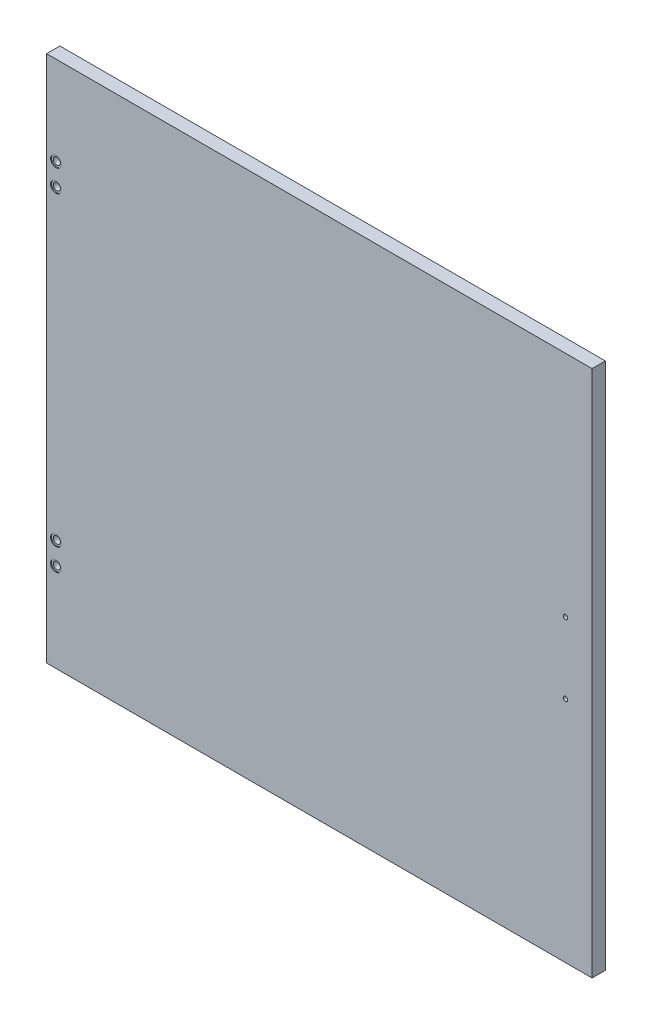
ISO-10303-21;
HEADER;
FILE_DESCRIPTION(('STEP AP214'),'2;1');
FILE_NAME('part.step','',(''),(''),'','','');
FILE_SCHEMA(('AUTOMOTIVE_DESIGN { 1 0 10303 214 1 1 1 1 }'));
ENDSEC;
DATA;
#1=APPLICATION_CONTEXT('core data for automotive mechanical design processes');
#2=APPLICATION_PROTOCOL_DEFINITION('international standard','automotive_design',2000,#1);
#3=PRODUCT_CONTEXT('',#1,'mechanical');
#4=PRODUCT('Part','Part','',(#3));
#5=PRODUCT_RELATED_PRODUCT_CATEGORY('part','',(#4));
#6=PRODUCT_DEFINITION_FORMATION('','',#4);
#7=PRODUCT_DEFINITION_CONTEXT('part definition',#1,'design');
#8=PRODUCT_DEFINITION('design','',#6,#7);
#9=PRODUCT_DEFINITION_SHAPE('','',#8);
#10=(LENGTH_UNIT() NAMED_UNIT(*) SI_UNIT(.MILLI.,.METRE.));
#11=(NAMED_UNIT(*) PLANE_ANGLE_UNIT() SI_UNIT($,.RADIAN.));
#12=(NAMED_UNIT(*) SI_UNIT($,.STERADIAN.) SOLID_ANGLE_UNIT());
#13=UNCERTAINTY_MEASURE_WITH_UNIT(LENGTH_MEASURE(1.E-05),#10,'distance_accuracy_value','');
#14=(GEOMETRIC_REPRESENTATION_CONTEXT(3) GLOBAL_UNCERTAINTY_ASSIGNED_CONTEXT((#13)) GLOBAL_UNIT_ASSIGNED_CONTEXT((#10,
#11,#12)) REPRESENTATION_CONTEXT('',''));
#15=CARTESIAN_POINT('',(0.,0.,0.));
#16=DIRECTION('',(0.,0.,1.));
#17=DIRECTION('',(1.,0.,0.));
#18=AXIS2_PLACEMENT_3D('',#15,#16,#17);
#19=CARTESIAN_POINT('',(-297.,-172.5,0.));
#20=DIRECTION('',(0.,0.,1.));
#21=DIRECTION('',(1.,0.,0.));
#22=AXIS2_PLACEMENT_3D('',#19,#20,#21);
#23=CYLINDRICAL_SURFACE('',#22,3.99999999999999);
#24=CARTESIAN_POINT('',(-297.,-172.5,0.));
#25=DIRECTION('',(0.,0.,-1.));
#26=DIRECTION('',(1.,0.,0.));
#27=AXIS2_PLACEMENT_3D('',#24,#25,#26);
#28=CIRCLE('',#27,3.99999999999999);
#29=CARTESIAN_POINT('',(-293.,-172.5,0.));
#30=VERTEX_POINT('',#29);
#31=EDGE_CURVE('E119',#30,#30,#28,.T.);
#32=ORIENTED_EDGE('',*,*,#31,.T.);
#33=EDGE_LOOP('',(#32));
#34=FACE_BOUND('',#33,.T.);
#35=CARTESIAN_POINT('',(-297.,-172.5,14.));
#36=DIRECTION('',(0.,0.,1.));
#37=DIRECTION('',(1.,0.,0.));
#38=AXIS2_PLACEMENT_3D('',#35,#36,#37);
#39=CIRCLE('',#38,3.99999999999999);
#40=CARTESIAN_POINT('',(-293.,-172.5,14.));
#41=VERTEX_POINT('',#40);
#42=EDGE_CURVE('E41',#41,#41,#39,.T.);
#43=ORIENTED_EDGE('',*,*,#42,.T.);
#44=EDGE_LOOP('',(#43));
#45=FACE_BOUND('',#44,.T.);
#46=ADVANCED_FACE('F37',(#34,#45),#23,.F.);
#47=CARTESIAN_POINT('',(-297.,-197.5,0.));
#48=DIRECTION('',(0.,0.,1.));
#49=DIRECTION('',(1.,0.,0.));
#50=AXIS2_PLACEMENT_3D('',#47,#48,#49);
#51=CYLINDRICAL_SURFACE('',#50,3.99999999999999);
#52=CARTESIAN_POINT('',(-297.,-197.5,0.));
#53=DIRECTION('',(0.,0.,-1.));
#54=DIRECTION('',(1.,0.,0.));
#55=AXIS2_PLACEMENT_3D('',#52,#53,#54);
#56=CIRCLE('',#55,3.99999999999999);
#57=CARTESIAN_POINT('',(-293.,-197.5,0.));
#58=VERTEX_POINT('',#57);
#59=EDGE_CURVE('E155',#58,#58,#56,.T.);
#60=ORIENTED_EDGE('',*,*,#59,.T.);
#61=EDGE_LOOP('',(#60));
#62=FACE_BOUND('',#61,.T.);
#63=CARTESIAN_POINT('',(-297.,-197.5,14.));
#64=DIRECTION('',(0.,0.,1.));
#65=DIRECTION('',(1.,0.,0.));
#66=AXIS2_PLACEMENT_3D('',#63,#64,#65);
#67=CIRCLE('',#66,3.99999999999999);
#68=CARTESIAN_POINT('',(-293.,-197.5,14.));
#69=VERTEX_POINT('',#68);
#70=EDGE_CURVE('E120',#69,#69,#67,.T.);
#71=ORIENTED_EDGE('',*,*,#70,.T.);
#72=EDGE_LOOP('',(#71));
#73=FACE_BOUND('',#72,.T.);
#74=ADVANCED_FACE('F173',(#62,#73),#51,.F.);
#75=CARTESIAN_POINT('',(-297.,172.5,0.));
#76=DIRECTION('',(0.,0.,1.));
#77=DIRECTION('',(1.,0.,0.));
#78=AXIS2_PLACEMENT_3D('',#75,#76,#77);
#79=CYLINDRICAL_SURFACE('',#78,3.99999999999999);
#80=CARTESIAN_POINT('',(-297.,172.5,0.));
#81=DIRECTION('',(0.,0.,1.));
#82=DIRECTION('',(1.,0.,0.));
#83=AXIS2_PLACEMENT_3D('',#80,#81,#82);
#84=CIRCLE('',#83,3.99999999999999);
#85=CARTESIAN_POINT('',(-293.,172.5,0.));
#86=VERTEX_POINT('',#85);
#87=EDGE_CURVE('E158',#86,#86,#84,.T.);
#88=ORIENTED_EDGE('',*,*,#87,.F.);
#89=EDGE_LOOP('',(#88));
#90=FACE_BOUND('',#89,.T.);
#91=CARTESIAN_POINT('',(-297.,172.5,14.));
#92=DIRECTION('',(0.,0.,1.));
#93=DIRECTION('',(1.,0.,0.));
#94=AXIS2_PLACEMENT_3D('',#91,#92,#93);
#95=CIRCLE('',#94,3.99999999999999);
#96=CARTESIAN_POINT('',(-293.,172.5,14.));
#97=VERTEX_POINT('',#96);
#98=EDGE_CURVE('E116',#97,#97,#95,.F.);
#99=ORIENTED_EDGE('',*,*,#98,.F.);
#100=EDGE_LOOP('',(#99));
#101=FACE_BOUND('',#100,.T.);
#102=ADVANCED_FACE('F169',(#90,#101),#79,.F.);
#103=CARTESIAN_POINT('',(-297.,197.5,0.));
#104=DIRECTION('',(0.,0.,1.));
#105=DIRECTION('',(1.,0.,0.));
#106=AXIS2_PLACEMENT_3D('',#103,#104,#105);
#107=CYLINDRICAL_SURFACE('',#106,3.99999999999999);
#108=CARTESIAN_POINT('',(-297.,197.5,0.));
#109=DIRECTION('',(0.,0.,1.));
#110=DIRECTION('',(1.,0.,0.));
#111=AXIS2_PLACEMENT_3D('',#108,#109,#110);
#112=CIRCLE('',#111,3.99999999999999);
#113=CARTESIAN_POINT('',(-293.,197.5,0.));
#114=VERTEX_POINT('',#113);
#115=EDGE_CURVE('E107',#114,#114,#112,.T.);
#116=ORIENTED_EDGE('',*,*,#115,.F.);
#117=EDGE_LOOP('',(#116));
#118=FACE_BOUND('',#117,.T.);
#119=CARTESIAN_POINT('',(-297.,197.5,14.));
#120=DIRECTION('',(0.,0.,1.));
#121=DIRECTION('',(1.,0.,0.));
#122=AXIS2_PLACEMENT_3D('',#119,#120,#121);
#123=CIRCLE('',#122,3.99999999999999);
#124=CARTESIAN_POINT('',(-293.,197.5,14.));
#125=VERTEX_POINT('',#124);
#126=EDGE_CURVE('E113',#125,#125,#123,.F.);
#127=ORIENTED_EDGE('',*,*,#126,.F.);
#128=EDGE_LOOP('',(#127));
#129=FACE_BOUND('',#128,.T.);
#130=ADVANCED_FACE('F172',(#118,#129),#107,.F.);
#131=CARTESIAN_POINT('',(307.5,297.5,15.));
#132=DIRECTION('',(-1.,0.,0.));
#133=DIRECTION('',(0.,-1.,0.));
#134=AXIS2_PLACEMENT_3D('',#131,#132,#133);
#135=PLANE('',#134);
#136=DIRECTION('',(0.,1.,0.));
#137=VECTOR('',#136,1.);
#138=CARTESIAN_POINT('',(307.5,297.5,0.));
#139=LINE('',#138,#137);
#140=CARTESIAN_POINT('',(307.5,-297.5,0.));
#141=VERTEX_POINT('',#140);
#142=CARTESIAN_POINT('',(307.5,297.5,0.));
#143=VERTEX_POINT('',#142);
#144=EDGE_CURVE('E104',#141,#143,#139,.T.);
#145=ORIENTED_EDGE('',*,*,#144,.T.);
#146=DIRECTION('',(0.,0.,-1.));
#147=VECTOR('',#146,1.);
#148=CARTESIAN_POINT('',(307.5,297.5,15.));
#149=LINE('',#148,#147);
#150=CARTESIAN_POINT('',(307.5,297.5,15.));
#151=VERTEX_POINT('',#150);
#152=EDGE_CURVE('E11',#151,#143,#149,.T.);
#153=ORIENTED_EDGE('',*,*,#152,.F.);
#154=DIRECTION('',(0.,1.,0.));
#155=VECTOR('',#154,1.);
#156=CARTESIAN_POINT('',(307.5,297.5,15.));
#157=LINE('',#156,#155);
#158=CARTESIAN_POINT('',(307.5,-297.5,15.));
#159=VERTEX_POINT('',#158);
#160=EDGE_CURVE('E91',#159,#151,#157,.T.);
#161=ORIENTED_EDGE('',*,*,#160,.F.);
#162=DIRECTION('',(0.,0.,-1.));
#163=VECTOR('',#162,1.);
#164=CARTESIAN_POINT('',(307.5,-297.5,15.));
#165=LINE('',#164,#163);
#166=EDGE_CURVE('E100',#159,#141,#165,.T.);
#167=ORIENTED_EDGE('',*,*,#166,.T.);
#168=EDGE_LOOP('',(#145,#153,#161,#167));
#169=FACE_BOUND('',#168,.T.);
#170=ADVANCED_FACE('F39',(#169),#135,.F.);
#171=CARTESIAN_POINT('',(-307.5,297.5,15.));
#172=DIRECTION('',(0.,-1.,0.));
#173=DIRECTION('',(0.,0.,-1.));
#174=AXIS2_PLACEMENT_3D('',#171,#172,#173);
#175=PLANE('',#174);
#176=DIRECTION('',(-1.,0.,0.));
#177=VECTOR('',#176,1.);
#178=CARTESIAN_POINT('',(-307.5,297.5,0.));
#179=LINE('',#178,#177);
#180=CARTESIAN_POINT('',(-307.5,297.5,0.));
#181=VERTEX_POINT('',#180);
#182=EDGE_CURVE('E95',#143,#181,#179,.T.);
#183=ORIENTED_EDGE('',*,*,#182,.T.);
#184=DIRECTION('',(0.,0.,-1.));
#185=VECTOR('',#184,1.);
#186=CARTESIAN_POINT('',(-307.5,297.5,15.));
#187=LINE('',#186,#185);
#188=CARTESIAN_POINT('',(-307.5,297.5,15.));
#189=VERTEX_POINT('',#188);
#190=EDGE_CURVE('E47',#189,#181,#187,.T.);
#191=ORIENTED_EDGE('',*,*,#190,.F.);
#192=DIRECTION('',(-1.,0.,0.));
#193=VECTOR('',#192,1.);
#194=CARTESIAN_POINT('',(-307.5,297.5,15.));
#195=LINE('',#194,#193);
#196=EDGE_CURVE('E86',#151,#189,#195,.T.);
#197=ORIENTED_EDGE('',*,*,#196,.F.);
#198=ORIENTED_EDGE('',*,*,#152,.T.);
#199=EDGE_LOOP('',(#183,#191,#197,#198));
#200=FACE_BOUND('',#199,.T.);
#201=ADVANCED_FACE('F94',(#200),#175,.F.);
#202=CARTESIAN_POINT('',(-307.5,297.5,15.));
#203=DIRECTION('',(1.,0.,0.));
#204=DIRECTION('',(0.,1.,0.));
#205=AXIS2_PLACEMENT_3D('',#202,#203,#204);
#206=PLANE('',#205);
#207=DIRECTION('',(0.,-1.,0.));
#208=VECTOR('',#207,1.);
#209=CARTESIAN_POINT('',(-307.5,297.5,0.));
#210=LINE('',#209,#208);
#211=CARTESIAN_POINT('',(-307.5,-297.5,0.));
#212=VERTEX_POINT('',#211);
#213=EDGE_CURVE('E73',#181,#212,#210,.T.);
#214=ORIENTED_EDGE('',*,*,#213,.T.);
#215=DIRECTION('',(0.,0.,-1.));
#216=VECTOR('',#215,1.);
#217=CARTESIAN_POINT('',(-307.5,-297.5,15.));
#218=LINE('',#217,#216);
#219=CARTESIAN_POINT('',(-307.5,-297.5,15.));
#220=VERTEX_POINT('',#219);
#221=EDGE_CURVE('E96',#220,#212,#218,.T.);
#222=ORIENTED_EDGE('',*,*,#221,.F.);
#223=DIRECTION('',(0.,-1.,0.));
#224=VECTOR('',#223,1.);
#225=CARTESIAN_POINT('',(-307.5,297.5,15.));
#226=LINE('',#225,#224);
#227=EDGE_CURVE('E89',#189,#220,#226,.T.);
#228=ORIENTED_EDGE('',*,*,#227,.F.);
#229=ORIENTED_EDGE('',*,*,#190,.T.);
#230=EDGE_LOOP('',(#214,#222,#228,#229));
#231=FACE_BOUND('',#230,.T.);
#232=ADVANCED_FACE('F98',(#231),#206,.F.);
#233=CARTESIAN_POINT('',(-307.5,-297.5,15.));
#234=DIRECTION('',(0.,1.,0.));
#235=DIRECTION('',(0.,0.,1.));
#236=AXIS2_PLACEMENT_3D('',#233,#234,#235);
#237=PLANE('',#236);
#238=DIRECTION('',(1.,0.,0.));
#239=VECTOR('',#238,1.);
#240=CARTESIAN_POINT('',(-307.5,-297.5,0.));
#241=LINE('',#240,#239);
#242=EDGE_CURVE('E79',#212,#141,#241,.T.);
#243=ORIENTED_EDGE('',*,*,#242,.T.);
#244=ORIENTED_EDGE('',*,*,#166,.F.);
#245=DIRECTION('',(1.,0.,0.));
#246=VECTOR('',#245,1.);
#247=CARTESIAN_POINT('',(-307.5,-297.5,15.));
#248=LINE('',#247,#246);
#249=EDGE_CURVE('E56',#220,#159,#248,.T.);
#250=ORIENTED_EDGE('',*,*,#249,.F.);
#251=ORIENTED_EDGE('',*,*,#221,.T.);
#252=EDGE_LOOP('',(#243,#244,#250,#251));
#253=FACE_BOUND('',#252,.T.);
#254=ADVANCED_FACE('F208',(#253),#237,.F.);
#255=CARTESIAN_POINT('',(0.,0.,15.));
#256=DIRECTION('',(0.,0.,1.));
#257=DIRECTION('',(1.,0.,0.));
#258=AXIS2_PLACEMENT_3D('',#255,#256,#257);
#259=PLANE('',#258);
#260=CARTESIAN_POINT('',(277.5,40.,15.));
#261=DIRECTION('',(0.,0.,1.));
#262=DIRECTION('',(1.,0.,0.));
#263=AXIS2_PLACEMENT_3D('',#260,#261,#262);
#264=CIRCLE('',#263,2.50000000000002);
#265=CARTESIAN_POINT('',(280.,40.,15.));
#266=VERTEX_POINT('',#265);
#267=EDGE_CURVE('E535',#266,#266,#264,.T.);
#268=ORIENTED_EDGE('',*,*,#267,.F.);
#269=EDGE_LOOP('',(#268));
#270=FACE_BOUND('',#269,.T.);
#271=CARTESIAN_POINT('',(277.5,-40.,15.));
#272=DIRECTION('',(0.,0.,1.));
#273=DIRECTION('',(1.,0.,0.));
#274=AXIS2_PLACEMENT_3D('',#271,#272,#273);
#275=CIRCLE('',#274,2.50000000000002);
#276=CARTESIAN_POINT('',(280.,-40.,15.));
#277=VERTEX_POINT('',#276);
#278=EDGE_CURVE('E537',#277,#277,#275,.T.);
#279=ORIENTED_EDGE('',*,*,#278,.F.);
#280=EDGE_LOOP('',(#279));
#281=FACE_BOUND('',#280,.T.);
#282=CARTESIAN_POINT('',(-297.,-197.5,15.));
#283=DIRECTION('',(0.,0.,-1.));
#284=DIRECTION('',(1.,0.,0.));
#285=AXIS2_PLACEMENT_3D('',#282,#283,#284);
#286=CIRCLE('',#285,5.99999999999999);
#287=CARTESIAN_POINT('',(-291.,-197.5,15.));
#288=VERTEX_POINT('',#287);
#289=EDGE_CURVE('E128',#288,#288,#286,.T.);
#290=ORIENTED_EDGE('',*,*,#289,.T.);
#291=EDGE_LOOP('',(#290));
#292=FACE_BOUND('',#291,.T.);
#293=CARTESIAN_POINT('',(-297.,-172.5,15.));
#294=DIRECTION('',(0.,0.,-1.));
#295=DIRECTION('',(1.,0.,0.));
#296=AXIS2_PLACEMENT_3D('',#293,#294,#295);
#297=CIRCLE('',#296,5.99999999999999);
#298=CARTESIAN_POINT('',(-291.,-172.5,15.));
#299=VERTEX_POINT('',#298);
#300=EDGE_CURVE('E141',#299,#299,#297,.T.);
#301=ORIENTED_EDGE('',*,*,#300,.T.);
#302=EDGE_LOOP('',(#301));
#303=FACE_BOUND('',#302,.T.);
#304=CARTESIAN_POINT('',(-297.,197.5,15.));
#305=DIRECTION('',(0.,0.,1.));
#306=DIRECTION('',(1.,0.,0.));
#307=AXIS2_PLACEMENT_3D('',#304,#305,#306);
#308=CIRCLE('',#307,5.99999999999999);
#309=CARTESIAN_POINT('',(-291.,197.5,15.));
#310=VERTEX_POINT('',#309);
#311=EDGE_CURVE('E147',#310,#310,#308,.T.);
#312=ORIENTED_EDGE('',*,*,#311,.F.);
#313=EDGE_LOOP('',(#312));
#314=FACE_BOUND('',#313,.T.);
#315=CARTESIAN_POINT('',(-297.,172.5,15.));
#316=DIRECTION('',(0.,0.,1.));
#317=DIRECTION('',(1.,0.,0.));
#318=AXIS2_PLACEMENT_3D('',#315,#316,#317);
#319=CIRCLE('',#318,5.99999999999999);
#320=CARTESIAN_POINT('',(-291.,172.5,15.));
#321=VERTEX_POINT('',#320);
#322=EDGE_CURVE('E150',#321,#321,#319,.T.);
#323=ORIENTED_EDGE('',*,*,#322,.F.);
#324=EDGE_LOOP('',(#323));
#325=FACE_BOUND('',#324,.T.);
#326=ORIENTED_EDGE('',*,*,#160,.T.);
#327=ORIENTED_EDGE('',*,*,#196,.T.);
#328=ORIENTED_EDGE('',*,*,#227,.T.);
#329=ORIENTED_EDGE('',*,*,#249,.T.);
#330=EDGE_LOOP('',(#326,#327,#328,#329));
#331=FACE_BOUND('',#330,.T.);
#332=ADVANCED_FACE('F87',(#270,#281,#292,#303,#314,#325,#331),#259,.T.);
#333=CARTESIAN_POINT('',(0.,0.,0.));
#334=DIRECTION('',(0.,0.,1.));
#335=DIRECTION('',(1.,0.,0.));
#336=AXIS2_PLACEMENT_3D('',#333,#334,#335);
#337=PLANE('',#336);
#338=CARTESIAN_POINT('',(298.,-197.5,0.));
#339=DIRECTION('',(0.,0.,-1.));
#340=DIRECTION('',(1.,0.,0.));
#341=AXIS2_PLACEMENT_3D('',#338,#339,#340);
#342=CIRCLE('',#341,2.);
#343=CARTESIAN_POINT('',(300.,-197.5,0.));
#344=VERTEX_POINT('',#343);
#345=EDGE_CURVE('E511',#344,#344,#342,.T.);
#346=ORIENTED_EDGE('',*,*,#345,.F.);
#347=EDGE_LOOP('',(#346));
#348=FACE_BOUND('',#347,.T.);
#349=CARTESIAN_POINT('',(298.,-167.5,0.));
#350=DIRECTION('',(0.,0.,-1.));
#351=DIRECTION('',(1.,0.,0.));
#352=AXIS2_PLACEMENT_3D('',#349,#350,#351);
#353=CIRCLE('',#352,2.);
#354=CARTESIAN_POINT('',(300.,-167.5,0.));
#355=VERTEX_POINT('',#354);
#356=EDGE_CURVE('E522',#355,#355,#353,.T.);
#357=ORIENTED_EDGE('',*,*,#356,.F.);
#358=EDGE_LOOP('',(#357));
#359=FACE_BOUND('',#358,.T.);
#360=CARTESIAN_POINT('',(298.,197.5,0.));
#361=DIRECTION('',(0.,0.,1.));
#362=DIRECTION('',(1.,0.,0.));
#363=AXIS2_PLACEMENT_3D('',#360,#361,#362);
#364=CIRCLE('',#363,2.);
#365=CARTESIAN_POINT('',(300.,197.5,0.));
#366=VERTEX_POINT('',#365);
#367=EDGE_CURVE('E528',#366,#366,#364,.T.);
#368=ORIENTED_EDGE('',*,*,#367,.T.);
#369=EDGE_LOOP('',(#368));
#370=FACE_BOUND('',#369,.T.);
#371=CARTESIAN_POINT('',(298.,167.5,0.));
#372=DIRECTION('',(0.,0.,1.));
#373=DIRECTION('',(1.,0.,0.));
#374=AXIS2_PLACEMENT_3D('',#371,#372,#373);
#375=CIRCLE('',#374,2.);
#376=CARTESIAN_POINT('',(300.,167.5,0.));
#377=VERTEX_POINT('',#376);
#378=EDGE_CURVE('E514',#377,#377,#375,.T.);
#379=ORIENTED_EDGE('',*,*,#378,.T.);
#380=EDGE_LOOP('',(#379));
#381=FACE_BOUND('',#380,.T.);
#382=CARTESIAN_POINT('',(277.5,40.,0.));
#383=DIRECTION('',(0.,0.,1.));
#384=DIRECTION('',(1.,0.,0.));
#385=AXIS2_PLACEMENT_3D('',#382,#383,#384);
#386=CIRCLE('',#385,2.50000000000002);
#387=CARTESIAN_POINT('',(280.,40.,0.));
#388=VERTEX_POINT('',#387);
#389=EDGE_CURVE('E144',#388,#388,#386,.T.);
#390=ORIENTED_EDGE('',*,*,#389,.T.);
#391=EDGE_LOOP('',(#390));
#392=FACE_BOUND('',#391,.T.);
#393=CARTESIAN_POINT('',(277.5,-40.,0.));
#394=DIRECTION('',(0.,0.,1.));
#395=DIRECTION('',(1.,0.,0.));
#396=AXIS2_PLACEMENT_3D('',#393,#394,#395);
#397=CIRCLE('',#396,2.50000000000002);
#398=CARTESIAN_POINT('',(280.,-40.,0.));
#399=VERTEX_POINT('',#398);
#400=EDGE_CURVE('E136',#399,#399,#397,.T.);
#401=ORIENTED_EDGE('',*,*,#400,.T.);
#402=EDGE_LOOP('',(#401));
#403=FACE_BOUND('',#402,.T.);
#404=ORIENTED_EDGE('',*,*,#59,.F.);
#405=EDGE_LOOP('',(#404));
#406=FACE_BOUND('',#405,.T.);
#407=ORIENTED_EDGE('',*,*,#31,.F.);
#408=EDGE_LOOP('',(#407));
#409=FACE_BOUND('',#408,.T.);
#410=ORIENTED_EDGE('',*,*,#115,.T.);
#411=EDGE_LOOP('',(#410));
#412=FACE_BOUND('',#411,.T.);
#413=ORIENTED_EDGE('',*,*,#87,.T.);
#414=EDGE_LOOP('',(#413));
#415=FACE_BOUND('',#414,.T.);
#416=ORIENTED_EDGE('',*,*,#144,.F.);
#417=ORIENTED_EDGE('',*,*,#242,.F.);
#418=ORIENTED_EDGE('',*,*,#213,.F.);
#419=ORIENTED_EDGE('',*,*,#182,.F.);
#420=EDGE_LOOP('',(#416,#417,#418,#419));
#421=FACE_BOUND('',#420,.T.);
#422=ADVANCED_FACE('F166',(#348,#359,#370,#381,#392,#403,#406,#409,#412,#415,#421),#337,.F.);
#423=CARTESIAN_POINT('',(-297.,197.5,14.));
#424=DIRECTION('',(0.,0.,1.));
#425=DIRECTION('',(1.,0.,0.));
#426=AXIS2_PLACEMENT_3D('',#423,#424,#425);
#427=PLANE('',#426);
#428=CARTESIAN_POINT('',(-297.,197.5,14.));
#429=DIRECTION('',(0.,0.,1.));
#430=DIRECTION('',(1.,0.,0.));
#431=AXIS2_PLACEMENT_3D('',#428,#429,#430);
#432=CIRCLE('',#431,5.99999999999999);
#433=CARTESIAN_POINT('',(-291.,197.5,14.));
#434=VERTEX_POINT('',#433);
#435=EDGE_CURVE('E117',#434,#434,#432,.T.);
#436=ORIENTED_EDGE('',*,*,#435,.T.);
#437=EDGE_LOOP('',(#436));
#438=FACE_BOUND('',#437,.T.);
#439=ORIENTED_EDGE('',*,*,#126,.T.);
#440=EDGE_LOOP('',(#439));
#441=FACE_BOUND('',#440,.T.);
#442=ADVANCED_FACE('F190',(#438,#441),#427,.T.);
#443=CARTESIAN_POINT('',(-297.,197.5,14.));
#444=DIRECTION('',(0.,0.,1.));
#445=DIRECTION('',(1.,0.,0.));
#446=AXIS2_PLACEMENT_3D('',#443,#444,#445);
#447=CYLINDRICAL_SURFACE('',#446,5.99999999999999);
#448=ORIENTED_EDGE('',*,*,#435,.F.);
#449=EDGE_LOOP('',(#448));
#450=FACE_BOUND('',#449,.T.);
#451=ORIENTED_EDGE('',*,*,#311,.T.);
#452=EDGE_LOOP('',(#451));
#453=FACE_BOUND('',#452,.T.);
#454=ADVANCED_FACE('F180',(#450,#453),#447,.F.);
#455=CARTESIAN_POINT('',(-297.,172.5,14.));
#456=DIRECTION('',(0.,0.,1.));
#457=DIRECTION('',(1.,0.,0.));
#458=AXIS2_PLACEMENT_3D('',#455,#456,#457);
#459=PLANE('',#458);
#460=CARTESIAN_POINT('',(-297.,172.5,14.));
#461=DIRECTION('',(0.,0.,1.));
#462=DIRECTION('',(1.,0.,0.));
#463=AXIS2_PLACEMENT_3D('',#460,#461,#462);
#464=CIRCLE('',#463,5.99999999999999);
#465=CARTESIAN_POINT('',(-291.,172.5,14.));
#466=VERTEX_POINT('',#465);
#467=EDGE_CURVE('E126',#466,#466,#464,.T.);
#468=ORIENTED_EDGE('',*,*,#467,.T.);
#469=EDGE_LOOP('',(#468));
#470=FACE_BOUND('',#469,.T.);
#471=ORIENTED_EDGE('',*,*,#98,.T.);
#472=EDGE_LOOP('',(#471));
#473=FACE_BOUND('',#472,.T.);
#474=ADVANCED_FACE('F177',(#470,#473),#459,.T.);
#475=CARTESIAN_POINT('',(-297.,172.5,14.));
#476=DIRECTION('',(0.,0.,1.));
#477=DIRECTION('',(1.,0.,0.));
#478=AXIS2_PLACEMENT_3D('',#475,#476,#477);
#479=CYLINDRICAL_SURFACE('',#478,5.99999999999999);
#480=ORIENTED_EDGE('',*,*,#467,.F.);
#481=EDGE_LOOP('',(#480));
#482=FACE_BOUND('',#481,.T.);
#483=ORIENTED_EDGE('',*,*,#322,.T.);
#484=EDGE_LOOP('',(#483));
#485=FACE_BOUND('',#484,.T.);
#486=ADVANCED_FACE('F179',(#482,#485),#479,.F.);
#487=CARTESIAN_POINT('',(-297.,-197.5,14.));
#488=DIRECTION('',(0.,0.,1.));
#489=DIRECTION('',(1.,0.,0.));
#490=AXIS2_PLACEMENT_3D('',#487,#488,#489);
#491=CYLINDRICAL_SURFACE('',#490,5.99999999999999);
#492=CARTESIAN_POINT('',(-297.,-197.5,14.));
#493=DIRECTION('',(0.,0.,-1.));
#494=DIRECTION('',(1.,0.,0.));
#495=AXIS2_PLACEMENT_3D('',#492,#493,#494);
#496=CIRCLE('',#495,5.99999999999999);
#497=CARTESIAN_POINT('',(-291.,-197.5,14.));
#498=VERTEX_POINT('',#497);
#499=EDGE_CURVE('E122',#498,#498,#496,.T.);
#500=ORIENTED_EDGE('',*,*,#499,.T.);
#501=EDGE_LOOP('',(#500));
#502=FACE_BOUND('',#501,.T.);
#503=ORIENTED_EDGE('',*,*,#289,.F.);
#504=EDGE_LOOP('',(#503));
#505=FACE_BOUND('',#504,.T.);
#506=ADVANCED_FACE('F187',(#502,#505),#491,.F.);
#507=CARTESIAN_POINT('',(-297.,-197.5,14.));
#508=DIRECTION('',(0.,0.,1.));
#509=DIRECTION('',(1.,0.,0.));
#510=AXIS2_PLACEMENT_3D('',#507,#508,#509);
#511=PLANE('',#510);
#512=ORIENTED_EDGE('',*,*,#70,.F.);
#513=EDGE_LOOP('',(#512));
#514=FACE_BOUND('',#513,.T.);
#515=ORIENTED_EDGE('',*,*,#499,.F.);
#516=EDGE_LOOP('',(#515));
#517=FACE_BOUND('',#516,.T.);
#518=ADVANCED_FACE('F251',(#514,#517),#511,.T.);
#519=CARTESIAN_POINT('',(-297.,-172.5,14.));
#520=DIRECTION('',(0.,0.,1.));
#521=DIRECTION('',(1.,0.,0.));
#522=AXIS2_PLACEMENT_3D('',#519,#520,#521);
#523=CYLINDRICAL_SURFACE('',#522,5.99999999999999);
#524=CARTESIAN_POINT('',(-297.,-172.5,14.));
#525=DIRECTION('',(0.,0.,-1.));
#526=DIRECTION('',(1.,0.,0.));
#527=AXIS2_PLACEMENT_3D('',#524,#525,#526);
#528=CIRCLE('',#527,5.99999999999999);
#529=CARTESIAN_POINT('',(-291.,-172.5,14.));
#530=VERTEX_POINT('',#529);
#531=EDGE_CURVE('E133',#530,#530,#528,.T.);
#532=ORIENTED_EDGE('',*,*,#531,.T.);
#533=EDGE_LOOP('',(#532));
#534=FACE_BOUND('',#533,.T.);
#535=ORIENTED_EDGE('',*,*,#300,.F.);
#536=EDGE_LOOP('',(#535));
#537=FACE_BOUND('',#536,.T.);
#538=ADVANCED_FACE('F262',(#534,#537),#523,.F.);
#539=CARTESIAN_POINT('',(-297.,-172.5,14.));
#540=DIRECTION('',(0.,0.,1.));
#541=DIRECTION('',(1.,0.,0.));
#542=AXIS2_PLACEMENT_3D('',#539,#540,#541);
#543=PLANE('',#542);
#544=ORIENTED_EDGE('',*,*,#42,.F.);
#545=EDGE_LOOP('',(#544));
#546=FACE_BOUND('',#545,.T.);
#547=ORIENTED_EDGE('',*,*,#531,.F.);
#548=EDGE_LOOP('',(#547));
#549=FACE_BOUND('',#548,.T.);
#550=ADVANCED_FACE('F273',(#546,#549),#543,.T.);
#551=CARTESIAN_POINT('',(277.5,-40.,0.));
#552=DIRECTION('',(0.,0.,1.));
#553=DIRECTION('',(1.,0.,0.));
#554=AXIS2_PLACEMENT_3D('',#551,#552,#553);
#555=CYLINDRICAL_SURFACE('',#554,2.50000000000002);
#556=ORIENTED_EDGE('',*,*,#400,.F.);
#557=EDGE_LOOP('',(#556));
#558=FACE_BOUND('',#557,.T.);
#559=ORIENTED_EDGE('',*,*,#278,.T.);
#560=EDGE_LOOP('',(#559));
#561=FACE_BOUND('',#560,.T.);
#562=ADVANCED_FACE('F284',(#558,#561),#555,.F.);
#563=CARTESIAN_POINT('',(277.5,40.,0.));
#564=DIRECTION('',(0.,0.,1.));
#565=DIRECTION('',(1.,0.,0.));
#566=AXIS2_PLACEMENT_3D('',#563,#564,#565);
#567=CYLINDRICAL_SURFACE('',#566,2.50000000000002);
#568=ORIENTED_EDGE('',*,*,#389,.F.);
#569=EDGE_LOOP('',(#568));
#570=FACE_BOUND('',#569,.T.);
#571=ORIENTED_EDGE('',*,*,#267,.T.);
#572=EDGE_LOOP('',(#571));
#573=FACE_BOUND('',#572,.T.);
#574=ADVANCED_FACE('F304',(#570,#573),#567,.F.);
#575=CARTESIAN_POINT('',(298.,167.5,9.));
#576=DIRECTION('',(0.,0.,-1.));
#577=DIRECTION('',(-1.,0.,0.));
#578=AXIS2_PLACEMENT_3D('',#575,#576,#577);
#579=CYLINDRICAL_SURFACE('',#578,2.);
#580=CARTESIAN_POINT('',(298.,167.5,9.));
#581=DIRECTION('',(0.,0.,1.));
#582=DIRECTION('',(1.,0.,0.));
#583=AXIS2_PLACEMENT_3D('',#580,#581,#582);
#584=CIRCLE('',#583,2.);
#585=CARTESIAN_POINT('',(300.,167.5,9.));
#586=VERTEX_POINT('',#585);
#587=EDGE_CURVE('E510',#586,#586,#584,.T.);
#588=ORIENTED_EDGE('',*,*,#587,.T.);
#589=EDGE_LOOP('',(#588));
#590=FACE_BOUND('',#589,.T.);
#591=ORIENTED_EDGE('',*,*,#378,.F.);
#592=EDGE_LOOP('',(#591));
#593=FACE_BOUND('',#592,.T.);
#594=ADVANCED_FACE('F315',(#590,#593),#579,.F.);
#595=CARTESIAN_POINT('',(298.,167.5,9.));
#596=DIRECTION('',(0.,0.,1.));
#597=DIRECTION('',(1.,0.,0.));
#598=AXIS2_PLACEMENT_3D('',#595,#596,#597);
#599=PLANE('',#598);
#600=ORIENTED_EDGE('',*,*,#587,.F.);
#601=EDGE_LOOP('',(#600));
#602=FACE_BOUND('',#601,.T.);
#603=ADVANCED_FACE('F326',(#602),#599,.F.);
#604=CARTESIAN_POINT('',(298.,197.5,9.));
#605=DIRECTION('',(0.,0.,-1.));
#606=DIRECTION('',(-1.,0.,0.));
#607=AXIS2_PLACEMENT_3D('',#604,#605,#606);
#608=CYLINDRICAL_SURFACE('',#607,2.);
#609=CARTESIAN_POINT('',(298.,197.5,9.));
#610=DIRECTION('',(0.,0.,1.));
#611=DIRECTION('',(1.,0.,0.));
#612=AXIS2_PLACEMENT_3D('',#609,#610,#611);
#613=CIRCLE('',#612,2.);
#614=CARTESIAN_POINT('',(300.,197.5,9.));
#615=VERTEX_POINT('',#614);
#616=EDGE_CURVE('E525',#615,#615,#613,.T.);
#617=ORIENTED_EDGE('',*,*,#616,.T.);
#618=EDGE_LOOP('',(#617));
#619=FACE_BOUND('',#618,.T.);
#620=ORIENTED_EDGE('',*,*,#367,.F.);
#621=EDGE_LOOP('',(#620));
#622=FACE_BOUND('',#621,.T.);
#623=ADVANCED_FACE('F337',(#619,#622),#608,.F.);
#624=CARTESIAN_POINT('',(298.,197.5,9.));
#625=DIRECTION('',(0.,0.,1.));
#626=DIRECTION('',(1.,0.,0.));
#627=AXIS2_PLACEMENT_3D('',#624,#625,#626);
#628=PLANE('',#627);
#629=ORIENTED_EDGE('',*,*,#616,.F.);
#630=EDGE_LOOP('',(#629));
#631=FACE_BOUND('',#630,.T.);
#632=ADVANCED_FACE('F348',(#631),#628,.F.);
#633=CARTESIAN_POINT('',(298.,-167.5,9.));
#634=DIRECTION('',(0.,0.,-1.));
#635=DIRECTION('',(-1.,0.,0.));
#636=AXIS2_PLACEMENT_3D('',#633,#634,#635);
#637=CYLINDRICAL_SURFACE('',#636,2.);
#638=CARTESIAN_POINT('',(298.,-167.5,9.));
#639=DIRECTION('',(0.,0.,-1.));
#640=DIRECTION('',(1.,0.,0.));
#641=AXIS2_PLACEMENT_3D('',#638,#639,#640);
#642=CIRCLE('',#641,2.);
#643=CARTESIAN_POINT('',(300.,-167.5,9.));
#644=VERTEX_POINT('',#643);
#645=EDGE_CURVE('E517',#644,#644,#642,.T.);
#646=ORIENTED_EDGE('',*,*,#645,.F.);
#647=EDGE_LOOP('',(#646));
#648=FACE_BOUND('',#647,.T.);
#649=ORIENTED_EDGE('',*,*,#356,.T.);
#650=EDGE_LOOP('',(#649));
#651=FACE_BOUND('',#650,.T.);
#652=ADVANCED_FACE('F359',(#648,#651),#637,.F.);
#653=CARTESIAN_POINT('',(298.,-167.5,9.));
#654=DIRECTION('',(0.,0.,1.));
#655=DIRECTION('',(1.,0.,0.));
#656=AXIS2_PLACEMENT_3D('',#653,#654,#655);
#657=PLANE('',#656);
#658=ORIENTED_EDGE('',*,*,#645,.T.);
#659=EDGE_LOOP('',(#658));
#660=FACE_BOUND('',#659,.T.);
#661=ADVANCED_FACE('F378',(#660),#657,.F.);
#662=CARTESIAN_POINT('',(298.,-197.5,9.));
#663=DIRECTION('',(0.,0.,-1.));
#664=DIRECTION('',(-1.,0.,0.));
#665=AXIS2_PLACEMENT_3D('',#662,#663,#664);
#666=CYLINDRICAL_SURFACE('',#665,2.);
#667=CARTESIAN_POINT('',(298.,-197.5,9.));
#668=DIRECTION('',(0.,0.,-1.));
#669=DIRECTION('',(1.,0.,0.));
#670=AXIS2_PLACEMENT_3D('',#667,#668,#669);
#671=CIRCLE('',#670,2.);
#672=CARTESIAN_POINT('',(300.,-197.5,9.));
#673=VERTEX_POINT('',#672);
#674=EDGE_CURVE('E509',#673,#673,#671,.T.);
#675=ORIENTED_EDGE('',*,*,#674,.F.);
#676=EDGE_LOOP('',(#675));
#677=FACE_BOUND('',#676,.T.);
#678=ORIENTED_EDGE('',*,*,#345,.T.);
#679=EDGE_LOOP('',(#678));
#680=FACE_BOUND('',#679,.T.);
#681=ADVANCED_FACE('F389',(#677,#680),#666,.F.);
#682=CARTESIAN_POINT('',(298.,-197.5,9.));
#683=DIRECTION('',(0.,0.,1.));
#684=DIRECTION('',(1.,0.,0.));
#685=AXIS2_PLACEMENT_3D('',#682,#683,#684);
#686=PLANE('',#685);
#687=ORIENTED_EDGE('',*,*,#674,.T.);
#688=EDGE_LOOP('',(#687));
#689=FACE_BOUND('',#688,.T.);
#690=ADVANCED_FACE('F400',(#689),#686,.F.);
#691=CLOSED_SHELL('',(#46,#74,#102,#130,#170,#201,#232,#254,#332,#422,#442,#454,#474,#486,#506,
#518,#538,#550,#562,#574,#594,#603,#623,#632,#652,#661,#681,#690));
#692=MANIFOLD_SOLID_BREP('B2',#691);
#693=ADVANCED_BREP_SHAPE_REPRESENTATION('',(#18,#692),#14);
#694=SHAPE_DEFINITION_REPRESENTATION(#9,#693);
ENDSEC;
END-ISO-10303-21;
